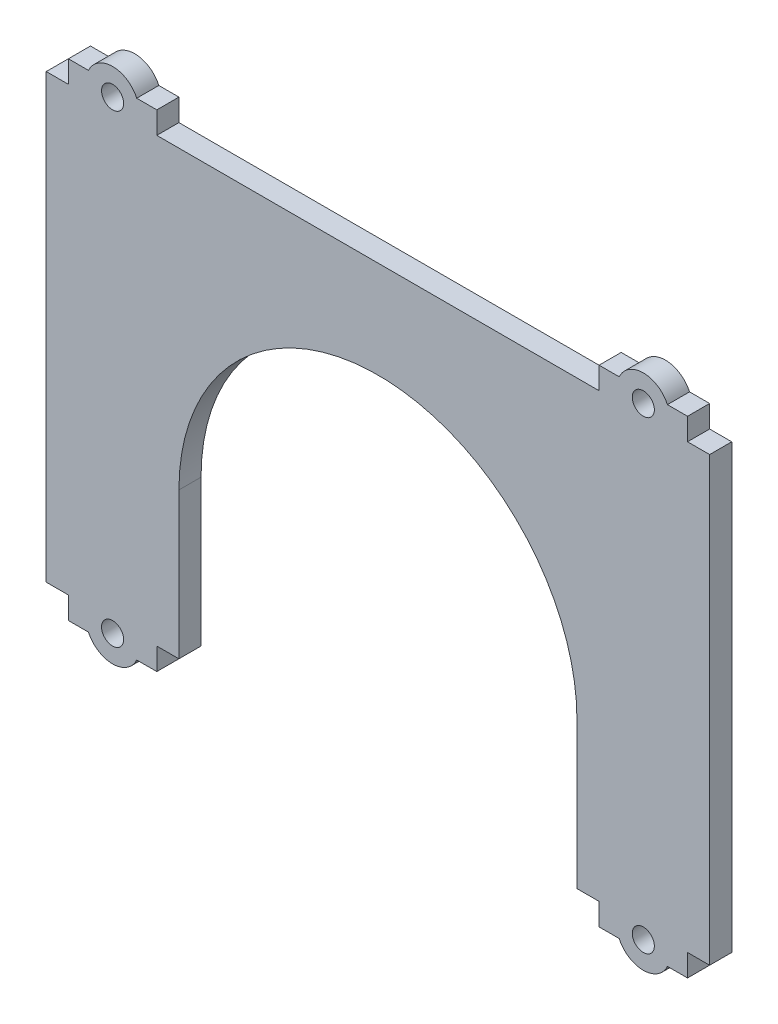
ISO-10303-21;
HEADER;
FILE_DESCRIPTION(('STEP AP214'),'2;1');
FILE_NAME('part.step','',(''),(''),'','','');
FILE_SCHEMA(('AUTOMOTIVE_DESIGN { 1 0 10303 214 1 1 1 1 }'));
ENDSEC;
DATA;
#1=APPLICATION_CONTEXT('core data for automotive mechanical design processes');
#2=APPLICATION_PROTOCOL_DEFINITION('international standard','automotive_design',2000,#1);
#3=PRODUCT_CONTEXT('',#1,'mechanical');
#4=PRODUCT('Part','Part','',(#3));
#5=PRODUCT_RELATED_PRODUCT_CATEGORY('part','',(#4));
#6=PRODUCT_DEFINITION_FORMATION('','',#4);
#7=PRODUCT_DEFINITION_CONTEXT('part definition',#1,'design');
#8=PRODUCT_DEFINITION('design','',#6,#7);
#9=PRODUCT_DEFINITION_SHAPE('','',#8);
#10=(LENGTH_UNIT() NAMED_UNIT(*) SI_UNIT(.MILLI.,.METRE.));
#11=(NAMED_UNIT(*) PLANE_ANGLE_UNIT() SI_UNIT($,.RADIAN.));
#12=(NAMED_UNIT(*) SI_UNIT($,.STERADIAN.) SOLID_ANGLE_UNIT());
#13=UNCERTAINTY_MEASURE_WITH_UNIT(LENGTH_MEASURE(1.E-05),#10,'distance_accuracy_value','');
#14=(GEOMETRIC_REPRESENTATION_CONTEXT(3) GLOBAL_UNCERTAINTY_ASSIGNED_CONTEXT((#13)) GLOBAL_UNIT_ASSIGNED_CONTEXT((#10,
#11,#12)) REPRESENTATION_CONTEXT('',''));
#15=CARTESIAN_POINT('',(0.,0.,0.));
#16=DIRECTION('',(0.,0.,1.));
#17=DIRECTION('',(1.,0.,0.));
#18=AXIS2_PLACEMENT_3D('',#15,#16,#17);
#19=CARTESIAN_POINT('',(75.,-50.,5.));
#20=DIRECTION('',(0.,1.,0.));
#21=DIRECTION('',(-1.,0.,0.));
#22=AXIS2_PLACEMENT_3D('',#19,#20,#21);
#23=PLANE('',#22);
#24=DIRECTION('',(0.,0.,-1.));
#25=VECTOR('',#24,1.);
#26=CARTESIAN_POINT('',(-45.,-50.,249.124704413899));
#27=LINE('',#26,#25);
#28=CARTESIAN_POINT('',(-45.,-50.,5.));
#29=VERTEX_POINT('',#28);
#30=CARTESIAN_POINT('',(-45.,-50.,0.));
#31=VERTEX_POINT('',#30);
#32=EDGE_CURVE('E254',#29,#31,#27,.T.);
#33=ORIENTED_EDGE('',*,*,#32,.F.);
#34=DIRECTION('',(1.,0.,0.));
#35=VECTOR('',#34,1.);
#36=CARTESIAN_POINT('',(75.,-50.,5.));
#37=LINE('',#36,#35);
#38=CARTESIAN_POINT('',(-50.,-50.,5.00000000000001));
#39=VERTEX_POINT('',#38);
#40=EDGE_CURVE('E446',#39,#29,#37,.T.);
#41=ORIENTED_EDGE('',*,*,#40,.F.);
#42=DIRECTION('',(0.,0.,1.));
#43=VECTOR('',#42,1.);
#44=CARTESIAN_POINT('',(-50.,-50.,0.));
#45=LINE('',#44,#43);
#46=CARTESIAN_POINT('',(-50.,-50.,0.));
#47=VERTEX_POINT('',#46);
#48=EDGE_CURVE('E412',#47,#39,#45,.T.);
#49=ORIENTED_EDGE('',*,*,#48,.F.);
#50=DIRECTION('',(1.,0.,0.));
#51=VECTOR('',#50,1.);
#52=CARTESIAN_POINT('',(75.,-50.,0.));
#53=LINE('',#52,#51);
#54=EDGE_CURVE('E461',#47,#31,#53,.T.);
#55=ORIENTED_EDGE('',*,*,#54,.T.);
#56=EDGE_LOOP('',(#33,#41,#49,#55));
#57=FACE_BOUND('',#56,.T.);
#58=ADVANCED_FACE('F35',(#57),#23,.F.);
#59=CARTESIAN_POINT('',(0.,0.,5.));
#60=DIRECTION('',(0.,0.,-1.));
#61=DIRECTION('',(-1.,0.,0.));
#62=AXIS2_PLACEMENT_3D('',#59,#60,#61);
#63=PLANE('',#62);
#64=CARTESIAN_POINT('',(60.,52.5,5.));
#65=DIRECTION('',(0.,0.,1.));
#66=DIRECTION('',(1.,0.,0.));
#67=AXIS2_PLACEMENT_3D('',#64,#65,#66);
#68=CIRCLE('',#67,2.5);
#69=CARTESIAN_POINT('',(62.5,52.5,5.));
#70=VERTEX_POINT('',#69);
#71=EDGE_CURVE('E304',#70,#70,#68,.T.);
#72=ORIENTED_EDGE('',*,*,#71,.F.);
#73=EDGE_LOOP('',(#72));
#74=FACE_BOUND('',#73,.T.);
#75=CARTESIAN_POINT('',(60.,-52.5,5.));
#76=DIRECTION('',(0.,0.,-1.));
#77=DIRECTION('',(1.,0.,0.));
#78=AXIS2_PLACEMENT_3D('',#75,#76,#77);
#79=CIRCLE('',#78,2.5);
#80=CARTESIAN_POINT('',(62.5,-52.5,5.));
#81=VERTEX_POINT('',#80);
#82=EDGE_CURVE('E281',#81,#81,#79,.T.);
#83=ORIENTED_EDGE('',*,*,#82,.T.);
#84=EDGE_LOOP('',(#83));
#85=FACE_BOUND('',#84,.T.);
#86=CARTESIAN_POINT('',(-60.,52.5,5.));
#87=DIRECTION('',(0.,0.,-1.));
#88=DIRECTION('',(-1.,0.,0.));
#89=AXIS2_PLACEMENT_3D('',#86,#87,#88);
#90=CIRCLE('',#89,2.5);
#91=CARTESIAN_POINT('',(-62.5,52.5,5.));
#92=VERTEX_POINT('',#91);
#93=EDGE_CURVE('E276',#92,#92,#90,.T.);
#94=ORIENTED_EDGE('',*,*,#93,.T.);
#95=EDGE_LOOP('',(#94));
#96=FACE_BOUND('',#95,.T.);
#97=CARTESIAN_POINT('',(-60.,-52.5,5.));
#98=DIRECTION('',(0.,0.,1.));
#99=DIRECTION('',(-1.,0.,0.));
#100=AXIS2_PLACEMENT_3D('',#97,#98,#99);
#101=CIRCLE('',#100,2.5);
#102=CARTESIAN_POINT('',(-62.5,-52.5,5.));
#103=VERTEX_POINT('',#102);
#104=EDGE_CURVE('E266',#103,#103,#101,.T.);
#105=ORIENTED_EDGE('',*,*,#104,.F.);
#106=EDGE_LOOP('',(#105));
#107=FACE_BOUND('',#106,.T.);
#108=DIRECTION('',(0.,1.,0.));
#109=VECTOR('',#108,1.);
#110=CARTESIAN_POINT('',(45.,-16.9280233832663,5.));
#111=LINE('',#110,#109);
#112=CARTESIAN_POINT('',(45.,-50.,5.));
#113=VERTEX_POINT('',#112);
#114=CARTESIAN_POINT('',(45.,-16.9280233832663,5.));
#115=VERTEX_POINT('',#114);
#116=EDGE_CURVE('E265',#113,#115,#111,.T.);
#117=ORIENTED_EDGE('',*,*,#116,.F.);
#118=CARTESIAN_POINT('',(50.,-50.,5.));
#119=VERTEX_POINT('',#118);
#120=EDGE_CURVE('E447',#113,#119,#37,.T.);
#121=ORIENTED_EDGE('',*,*,#120,.T.);
#122=DIRECTION('',(0.,1.,0.));
#123=VECTOR('',#122,1.);
#124=CARTESIAN_POINT('',(50.,-55.,5.00000000000001));
#125=LINE('',#124,#123);
#126=CARTESIAN_POINT('',(50.,-55.,5.00000000000001));
#127=VERTEX_POINT('',#126);
#128=EDGE_CURVE('E371',#127,#119,#125,.T.);
#129=ORIENTED_EDGE('',*,*,#128,.F.);
#130=DIRECTION('',(1.,0.,0.));
#131=VECTOR('',#130,1.);
#132=CARTESIAN_POINT('',(70.,-55.,5.));
#133=LINE('',#132,#131);
#134=CARTESIAN_POINT('',(54.5456439426821,-55.,5.));
#135=VERTEX_POINT('',#134);
#136=EDGE_CURVE('E352',#127,#135,#133,.T.);
#137=ORIENTED_EDGE('',*,*,#136,.T.);
#138=CARTESIAN_POINT('',(60.,-52.5,5.));
#139=DIRECTION('',(0.,0.,-1.));
#140=DIRECTION('',(1.,0.,0.));
#141=AXIS2_PLACEMENT_3D('',#138,#139,#140);
#142=CIRCLE('',#141,5.99999999999999);
#143=CARTESIAN_POINT('',(65.4543560573178,-55.,5.));
#144=VERTEX_POINT('',#143);
#145=EDGE_CURVE('E299',#144,#135,#142,.T.);
#146=ORIENTED_EDGE('',*,*,#145,.F.);
#147=CARTESIAN_POINT('',(70.,-55.,5.));
#148=VERTEX_POINT('',#147);
#149=EDGE_CURVE('E350',#144,#148,#133,.T.);
#150=ORIENTED_EDGE('',*,*,#149,.T.);
#151=DIRECTION('',(0.,1.,0.));
#152=VECTOR('',#151,1.);
#153=CARTESIAN_POINT('',(70.,-55.,5.));
#154=LINE('',#153,#152);
#155=CARTESIAN_POINT('',(70.,-50.,5.));
#156=VERTEX_POINT('',#155);
#157=EDGE_CURVE('E374',#148,#156,#154,.T.);
#158=ORIENTED_EDGE('',*,*,#157,.T.);
#159=CARTESIAN_POINT('',(75.,-50.,5.));
#160=VERTEX_POINT('',#159);
#161=EDGE_CURVE('E440',#156,#160,#37,.T.);
#162=ORIENTED_EDGE('',*,*,#161,.T.);
#163=DIRECTION('',(0.,1.,0.));
#164=VECTOR('',#163,1.);
#165=CARTESIAN_POINT('',(75.,50.,5.));
#166=LINE('',#165,#164);
#167=CARTESIAN_POINT('',(75.,50.,5.));
#168=VERTEX_POINT('',#167);
#169=EDGE_CURVE('E445',#160,#168,#166,.T.);
#170=ORIENTED_EDGE('',*,*,#169,.T.);
#171=DIRECTION('',(-1.,0.,0.));
#172=VECTOR('',#171,1.);
#173=CARTESIAN_POINT('',(75.,50.,5.));
#174=LINE('',#173,#172);
#175=CARTESIAN_POINT('',(70.,50.,5.));
#176=VERTEX_POINT('',#175);
#177=EDGE_CURVE('E450',#168,#176,#174,.T.);
#178=ORIENTED_EDGE('',*,*,#177,.T.);
#179=DIRECTION('',(0.,-1.,0.));
#180=VECTOR('',#179,1.);
#181=CARTESIAN_POINT('',(70.,55.,5.));
#182=LINE('',#181,#180);
#183=CARTESIAN_POINT('',(70.,55.,5.));
#184=VERTEX_POINT('',#183);
#185=EDGE_CURVE('E330',#184,#176,#182,.T.);
#186=ORIENTED_EDGE('',*,*,#185,.F.);
#187=DIRECTION('',(1.,0.,0.));
#188=VECTOR('',#187,1.);
#189=CARTESIAN_POINT('',(70.,55.,5.));
#190=LINE('',#189,#188);
#191=CARTESIAN_POINT('',(65.4543560573178,55.,5.));
#192=VERTEX_POINT('',#191);
#193=EDGE_CURVE('E327',#192,#184,#190,.T.);
#194=ORIENTED_EDGE('',*,*,#193,.F.);
#195=CARTESIAN_POINT('',(60.,52.5,5.));
#196=DIRECTION('',(0.,0.,1.));
#197=DIRECTION('',(1.,0.,0.));
#198=AXIS2_PLACEMENT_3D('',#195,#196,#197);
#199=CIRCLE('',#198,5.99999999999999);
#200=CARTESIAN_POINT('',(54.5456439426821,55.,5.00000000000001));
#201=VERTEX_POINT('',#200);
#202=EDGE_CURVE('E309',#192,#201,#199,.T.);
#203=ORIENTED_EDGE('',*,*,#202,.T.);
#204=CARTESIAN_POINT('',(50.,55.,5.00000000000001));
#205=VERTEX_POINT('',#204);
#206=EDGE_CURVE('E328',#205,#201,#190,.T.);
#207=ORIENTED_EDGE('',*,*,#206,.F.);
#208=DIRECTION('',(0.,-1.,0.));
#209=VECTOR('',#208,1.);
#210=CARTESIAN_POINT('',(50.,55.,5.00000000000001));
#211=LINE('',#210,#209);
#212=CARTESIAN_POINT('',(50.,50.,5.));
#213=VERTEX_POINT('',#212);
#214=EDGE_CURVE('E337',#205,#213,#211,.T.);
#215=ORIENTED_EDGE('',*,*,#214,.T.);
#216=CARTESIAN_POINT('',(-50.,50.,5.));
#217=VERTEX_POINT('',#216);
#218=EDGE_CURVE('E454',#213,#217,#174,.T.);
#219=ORIENTED_EDGE('',*,*,#218,.T.);
#220=DIRECTION('',(0.,-1.,0.));
#221=VECTOR('',#220,1.);
#222=CARTESIAN_POINT('',(-50.,55.,5.00000000000001));
#223=LINE('',#222,#221);
#224=CARTESIAN_POINT('',(-50.,55.,5.00000000000001));
#225=VERTEX_POINT('',#224);
#226=EDGE_CURVE('E402',#225,#217,#223,.T.);
#227=ORIENTED_EDGE('',*,*,#226,.F.);
#228=DIRECTION('',(-1.,0.,0.));
#229=VECTOR('',#228,1.);
#230=CARTESIAN_POINT('',(-70.,55.,5.));
#231=LINE('',#230,#229);
#232=CARTESIAN_POINT('',(-54.5456439426821,55.,5.));
#233=VERTEX_POINT('',#232);
#234=EDGE_CURVE('E383',#225,#233,#231,.T.);
#235=ORIENTED_EDGE('',*,*,#234,.T.);
#236=CARTESIAN_POINT('',(-60.,52.5,5.));
#237=DIRECTION('',(0.,0.,-1.));
#238=DIRECTION('',(-1.,0.,0.));
#239=AXIS2_PLACEMENT_3D('',#236,#237,#238);
#240=CIRCLE('',#239,5.99999999999999);
#241=CARTESIAN_POINT('',(-65.4543560573178,55.,5.));
#242=VERTEX_POINT('',#241);
#243=EDGE_CURVE('E293',#242,#233,#240,.T.);
#244=ORIENTED_EDGE('',*,*,#243,.F.);
#245=CARTESIAN_POINT('',(-70.,55.,5.));
#246=VERTEX_POINT('',#245);
#247=EDGE_CURVE('E381',#242,#246,#231,.T.);
#248=ORIENTED_EDGE('',*,*,#247,.T.);
#249=DIRECTION('',(0.,-1.,0.));
#250=VECTOR('',#249,1.);
#251=CARTESIAN_POINT('',(-70.,55.,5.));
#252=LINE('',#251,#250);
#253=CARTESIAN_POINT('',(-70.,50.,5.));
#254=VERTEX_POINT('',#253);
#255=EDGE_CURVE('E405',#246,#254,#252,.T.);
#256=ORIENTED_EDGE('',*,*,#255,.T.);
#257=CARTESIAN_POINT('',(-75.,50.,5.));
#258=VERTEX_POINT('',#257);
#259=EDGE_CURVE('E449',#254,#258,#174,.T.);
#260=ORIENTED_EDGE('',*,*,#259,.T.);
#261=DIRECTION('',(0.,-1.,0.));
#262=VECTOR('',#261,1.);
#263=CARTESIAN_POINT('',(-75.,50.,5.));
#264=LINE('',#263,#262);
#265=CARTESIAN_POINT('',(-75.,-50.,5.));
#266=VERTEX_POINT('',#265);
#267=EDGE_CURVE('E437',#258,#266,#264,.T.);
#268=ORIENTED_EDGE('',*,*,#267,.T.);
#269=CARTESIAN_POINT('',(-70.,-50.,5.));
#270=VERTEX_POINT('',#269);
#271=EDGE_CURVE('E442',#266,#270,#37,.T.);
#272=ORIENTED_EDGE('',*,*,#271,.T.);
#273=DIRECTION('',(0.,1.,0.));
#274=VECTOR('',#273,1.);
#275=CARTESIAN_POINT('',(-70.,-55.,5.));
#276=LINE('',#275,#274);
#277=CARTESIAN_POINT('',(-70.,-55.,5.));
#278=VERTEX_POINT('',#277);
#279=EDGE_CURVE('E420',#278,#270,#276,.T.);
#280=ORIENTED_EDGE('',*,*,#279,.F.);
#281=DIRECTION('',(-1.,0.,0.));
#282=VECTOR('',#281,1.);
#283=CARTESIAN_POINT('',(-70.,-55.,5.));
#284=LINE('',#283,#282);
#285=CARTESIAN_POINT('',(-65.4543560573178,-55.,5.));
#286=VERTEX_POINT('',#285);
#287=EDGE_CURVE('E417',#286,#278,#284,.T.);
#288=ORIENTED_EDGE('',*,*,#287,.F.);
#289=CARTESIAN_POINT('',(-60.,-52.5,5.));
#290=DIRECTION('',(0.,0.,1.));
#291=DIRECTION('',(-1.,0.,0.));
#292=AXIS2_PLACEMENT_3D('',#289,#290,#291);
#293=CIRCLE('',#292,5.99999999999999);
#294=CARTESIAN_POINT('',(-54.5456439426821,-55.,5.00000000000001));
#295=VERTEX_POINT('',#294);
#296=EDGE_CURVE('E287',#286,#295,#293,.T.);
#297=ORIENTED_EDGE('',*,*,#296,.T.);
#298=CARTESIAN_POINT('',(-50.,-55.,5.00000000000001));
#299=VERTEX_POINT('',#298);
#300=EDGE_CURVE('E418',#299,#295,#284,.T.);
#301=ORIENTED_EDGE('',*,*,#300,.F.);
#302=DIRECTION('',(0.,1.,0.));
#303=VECTOR('',#302,1.);
#304=CARTESIAN_POINT('',(-50.,-55.,5.00000000000001));
#305=LINE('',#304,#303);
#306=EDGE_CURVE('E427',#299,#39,#305,.T.);
#307=ORIENTED_EDGE('',*,*,#306,.T.);
#308=ORIENTED_EDGE('',*,*,#40,.T.);
#309=DIRECTION('',(0.,-1.,0.));
#310=VECTOR('',#309,1.);
#311=CARTESIAN_POINT('',(-45.,-16.9280233832663,5.));
#312=LINE('',#311,#310);
#313=CARTESIAN_POINT('',(-45.,-16.9280233832663,5.));
#314=VERTEX_POINT('',#313);
#315=EDGE_CURVE('E55',#314,#29,#312,.T.);
#316=ORIENTED_EDGE('',*,*,#315,.F.);
#317=CARTESIAN_POINT('',(0.,-16.9280233832663,5.));
#318=DIRECTION('',(0.,0.,-1.));
#319=DIRECTION('',(-1.,0.,0.));
#320=AXIS2_PLACEMENT_3D('',#317,#318,#319);
#321=CIRCLE('',#320,45.);
#322=EDGE_CURVE('E50',#115,#314,#321,.F.);
#323=ORIENTED_EDGE('',*,*,#322,.F.);
#324=EDGE_LOOP('',(#117,#121,#129,#137,#146,#150,#158,#162,#170,#178,#186,#194,#203,#207,#215,
#219,#227,#235,#244,#248,#256,#260,#268,#272,#280,#288,#297,#301,#307,#308,#316,#323));
#325=FACE_BOUND('',#324,.T.);
#326=ADVANCED_FACE('F514',(#74,#85,#96,#107,#325),#63,.F.);
#327=CARTESIAN_POINT('',(0.,0.,0.));
#328=DIRECTION('',(0.,0.,-1.));
#329=DIRECTION('',(-1.,0.,0.));
#330=AXIS2_PLACEMENT_3D('',#327,#328,#329);
#331=PLANE('',#330);
#332=CARTESIAN_POINT('',(-60.,-52.5,0.));
#333=DIRECTION('',(0.,0.,1.));
#334=DIRECTION('',(-1.,0.,0.));
#335=AXIS2_PLACEMENT_3D('',#332,#333,#334);
#336=CIRCLE('',#335,2.5);
#337=CARTESIAN_POINT('',(-62.5,-52.5,0.));
#338=VERTEX_POINT('',#337);
#339=EDGE_CURVE('E270',#338,#338,#336,.T.);
#340=ORIENTED_EDGE('',*,*,#339,.T.);
#341=EDGE_LOOP('',(#340));
#342=FACE_BOUND('',#341,.T.);
#343=CARTESIAN_POINT('',(-60.,52.5,0.));
#344=DIRECTION('',(0.,0.,-1.));
#345=DIRECTION('',(-1.,0.,0.));
#346=AXIS2_PLACEMENT_3D('',#343,#344,#345);
#347=CIRCLE('',#346,2.5);
#348=CARTESIAN_POINT('',(-62.5,52.5,0.));
#349=VERTEX_POINT('',#348);
#350=EDGE_CURVE('E278',#349,#349,#347,.T.);
#351=ORIENTED_EDGE('',*,*,#350,.F.);
#352=EDGE_LOOP('',(#351));
#353=FACE_BOUND('',#352,.T.);
#354=CARTESIAN_POINT('',(60.,-52.5,0.));
#355=DIRECTION('',(0.,0.,-1.));
#356=DIRECTION('',(1.,0.,0.));
#357=AXIS2_PLACEMENT_3D('',#354,#355,#356);
#358=CIRCLE('',#357,2.5);
#359=CARTESIAN_POINT('',(62.5,-52.5,0.));
#360=VERTEX_POINT('',#359);
#361=EDGE_CURVE('E284',#360,#360,#358,.T.);
#362=ORIENTED_EDGE('',*,*,#361,.F.);
#363=EDGE_LOOP('',(#362));
#364=FACE_BOUND('',#363,.T.);
#365=CARTESIAN_POINT('',(60.,52.5,0.));
#366=DIRECTION('',(0.,0.,1.));
#367=DIRECTION('',(1.,0.,0.));
#368=AXIS2_PLACEMENT_3D('',#365,#366,#367);
#369=CIRCLE('',#368,2.5);
#370=CARTESIAN_POINT('',(62.5,52.5,0.));
#371=VERTEX_POINT('',#370);
#372=EDGE_CURVE('E306',#371,#371,#369,.T.);
#373=ORIENTED_EDGE('',*,*,#372,.T.);
#374=EDGE_LOOP('',(#373));
#375=FACE_BOUND('',#374,.T.);
#376=CARTESIAN_POINT('',(0.,-16.9280233832663,0.));
#377=DIRECTION('',(0.,0.,-1.));
#378=DIRECTION('',(-1.,0.,0.));
#379=AXIS2_PLACEMENT_3D('',#376,#377,#378);
#380=CIRCLE('',#379,45.);
#381=CARTESIAN_POINT('',(45.,-16.9280233832663,0.));
#382=VERTEX_POINT('',#381);
#383=CARTESIAN_POINT('',(-45.,-16.9280233832663,0.));
#384=VERTEX_POINT('',#383);
#385=EDGE_CURVE('E247',#382,#384,#380,.F.);
#386=ORIENTED_EDGE('',*,*,#385,.T.);
#387=DIRECTION('',(0.,-1.,0.));
#388=VECTOR('',#387,1.);
#389=CARTESIAN_POINT('',(-45.,-16.9280233832663,0.));
#390=LINE('',#389,#388);
#391=EDGE_CURVE('E262',#384,#31,#390,.T.);
#392=ORIENTED_EDGE('',*,*,#391,.T.);
#393=ORIENTED_EDGE('',*,*,#54,.F.);
#394=DIRECTION('',(0.,1.,0.));
#395=VECTOR('',#394,1.);
#396=CARTESIAN_POINT('',(-50.,-55.,0.));
#397=LINE('',#396,#395);
#398=CARTESIAN_POINT('',(-50.,-55.,0.));
#399=VERTEX_POINT('',#398);
#400=EDGE_CURVE('E430',#399,#47,#397,.T.);
#401=ORIENTED_EDGE('',*,*,#400,.F.);
#402=DIRECTION('',(1.,0.,0.));
#403=VECTOR('',#402,1.);
#404=CARTESIAN_POINT('',(-70.,-55.,0.));
#405=LINE('',#404,#403);
#406=CARTESIAN_POINT('',(-54.5456439426821,-55.,0.));
#407=VERTEX_POINT('',#406);
#408=EDGE_CURVE('E411',#407,#399,#405,.T.);
#409=ORIENTED_EDGE('',*,*,#408,.F.);
#410=CARTESIAN_POINT('',(-60.,-52.5,0.));
#411=DIRECTION('',(0.,0.,1.));
#412=DIRECTION('',(-1.,0.,0.));
#413=AXIS2_PLACEMENT_3D('',#410,#411,#412);
#414=CIRCLE('',#413,5.99999999999999);
#415=CARTESIAN_POINT('',(-65.4543560573178,-55.,0.));
#416=VERTEX_POINT('',#415);
#417=EDGE_CURVE('E290',#416,#407,#414,.T.);
#418=ORIENTED_EDGE('',*,*,#417,.F.);
#419=CARTESIAN_POINT('',(-70.,-55.,0.));
#420=VERTEX_POINT('',#419);
#421=EDGE_CURVE('E413',#420,#416,#405,.T.);
#422=ORIENTED_EDGE('',*,*,#421,.F.);
#423=DIRECTION('',(0.,1.,0.));
#424=VECTOR('',#423,1.);
#425=CARTESIAN_POINT('',(-70.,-55.,0.));
#426=LINE('',#425,#424);
#427=CARTESIAN_POINT('',(-70.,-50.,0.));
#428=VERTEX_POINT('',#427);
#429=EDGE_CURVE('E433',#420,#428,#426,.T.);
#430=ORIENTED_EDGE('',*,*,#429,.T.);
#431=CARTESIAN_POINT('',(-75.,-50.,0.));
#432=VERTEX_POINT('',#431);
#433=EDGE_CURVE('E458',#432,#428,#53,.T.);
#434=ORIENTED_EDGE('',*,*,#433,.F.);
#435=DIRECTION('',(0.,-1.,0.));
#436=VECTOR('',#435,1.);
#437=CARTESIAN_POINT('',(-75.,50.,0.));
#438=LINE('',#437,#436);
#439=CARTESIAN_POINT('',(-75.,50.,0.));
#440=VERTEX_POINT('',#439);
#441=EDGE_CURVE('E436',#440,#432,#438,.T.);
#442=ORIENTED_EDGE('',*,*,#441,.F.);
#443=DIRECTION('',(-1.,0.,0.));
#444=VECTOR('',#443,1.);
#445=CARTESIAN_POINT('',(75.,50.,0.));
#446=LINE('',#445,#444);
#447=CARTESIAN_POINT('',(-70.,50.,0.));
#448=VERTEX_POINT('',#447);
#449=EDGE_CURVE('E463',#448,#440,#446,.T.);
#450=ORIENTED_EDGE('',*,*,#449,.F.);
#451=DIRECTION('',(0.,-1.,0.));
#452=VECTOR('',#451,1.);
#453=CARTESIAN_POINT('',(-70.,55.,0.));
#454=LINE('',#453,#452);
#455=CARTESIAN_POINT('',(-70.,55.,0.));
#456=VERTEX_POINT('',#455);
#457=EDGE_CURVE('E393',#456,#448,#454,.T.);
#458=ORIENTED_EDGE('',*,*,#457,.F.);
#459=DIRECTION('',(1.,0.,0.));
#460=VECTOR('',#459,1.);
#461=CARTESIAN_POINT('',(-70.,55.,0.));
#462=LINE('',#461,#460);
#463=CARTESIAN_POINT('',(-65.4543560573178,55.,0.));
#464=VERTEX_POINT('',#463);
#465=EDGE_CURVE('E390',#456,#464,#462,.T.);
#466=ORIENTED_EDGE('',*,*,#465,.T.);
#467=CARTESIAN_POINT('',(-60.,52.5,0.));
#468=DIRECTION('',(0.,0.,-1.));
#469=DIRECTION('',(-1.,0.,0.));
#470=AXIS2_PLACEMENT_3D('',#467,#468,#469);
#471=CIRCLE('',#470,5.99999999999999);
#472=CARTESIAN_POINT('',(-54.5456439426821,55.,0.));
#473=VERTEX_POINT('',#472);
#474=EDGE_CURVE('E296',#464,#473,#471,.T.);
#475=ORIENTED_EDGE('',*,*,#474,.T.);
#476=CARTESIAN_POINT('',(-50.,55.,0.));
#477=VERTEX_POINT('',#476);
#478=EDGE_CURVE('E389',#473,#477,#462,.T.);
#479=ORIENTED_EDGE('',*,*,#478,.T.);
#480=DIRECTION('',(0.,-1.,0.));
#481=VECTOR('',#480,1.);
#482=CARTESIAN_POINT('',(-50.,55.,0.));
#483=LINE('',#482,#481);
#484=CARTESIAN_POINT('',(-50.,50.,0.));
#485=VERTEX_POINT('',#484);
#486=EDGE_CURVE('E399',#477,#485,#483,.T.);
#487=ORIENTED_EDGE('',*,*,#486,.T.);
#488=CARTESIAN_POINT('',(50.,50.,0.));
#489=VERTEX_POINT('',#488);
#490=EDGE_CURVE('E465',#489,#485,#446,.T.);
#491=ORIENTED_EDGE('',*,*,#490,.F.);
#492=DIRECTION('',(0.,-1.,0.));
#493=VECTOR('',#492,1.);
#494=CARTESIAN_POINT('',(50.,55.,0.));
#495=LINE('',#494,#493);
#496=CARTESIAN_POINT('',(50.,55.,0.));
#497=VERTEX_POINT('',#496);
#498=EDGE_CURVE('E340',#497,#489,#495,.T.);
#499=ORIENTED_EDGE('',*,*,#498,.F.);
#500=DIRECTION('',(-1.,0.,0.));
#501=VECTOR('',#500,1.);
#502=CARTESIAN_POINT('',(70.,55.,0.));
#503=LINE('',#502,#501);
#504=CARTESIAN_POINT('',(54.5456439426821,55.,0.));
#505=VERTEX_POINT('',#504);
#506=EDGE_CURVE('E321',#505,#497,#503,.T.);
#507=ORIENTED_EDGE('',*,*,#506,.F.);
#508=CARTESIAN_POINT('',(60.,52.5,0.));
#509=DIRECTION('',(0.,0.,1.));
#510=DIRECTION('',(1.,0.,0.));
#511=AXIS2_PLACEMENT_3D('',#508,#509,#510);
#512=CIRCLE('',#511,5.99999999999999);
#513=CARTESIAN_POINT('',(65.4543560573178,55.,0.));
#514=VERTEX_POINT('',#513);
#515=EDGE_CURVE('E312',#514,#505,#512,.T.);
#516=ORIENTED_EDGE('',*,*,#515,.F.);
#517=CARTESIAN_POINT('',(70.,55.,0.));
#518=VERTEX_POINT('',#517);
#519=EDGE_CURVE('E323',#518,#514,#503,.T.);
#520=ORIENTED_EDGE('',*,*,#519,.F.);
#521=DIRECTION('',(0.,-1.,0.));
#522=VECTOR('',#521,1.);
#523=CARTESIAN_POINT('',(70.,55.,0.));
#524=LINE('',#523,#522);
#525=CARTESIAN_POINT('',(70.,50.,0.));
#526=VERTEX_POINT('',#525);
#527=EDGE_CURVE('E343',#518,#526,#524,.T.);
#528=ORIENTED_EDGE('',*,*,#527,.T.);
#529=CARTESIAN_POINT('',(75.,50.,0.));
#530=VERTEX_POINT('',#529);
#531=EDGE_CURVE('E441',#530,#526,#446,.T.);
#532=ORIENTED_EDGE('',*,*,#531,.F.);
#533=DIRECTION('',(0.,1.,0.));
#534=VECTOR('',#533,1.);
#535=CARTESIAN_POINT('',(75.,50.,0.));
#536=LINE('',#535,#534);
#537=CARTESIAN_POINT('',(75.,-50.,0.));
#538=VERTEX_POINT('',#537);
#539=EDGE_CURVE('E460',#538,#530,#536,.T.);
#540=ORIENTED_EDGE('',*,*,#539,.F.);
#541=CARTESIAN_POINT('',(70.,-50.,0.));
#542=VERTEX_POINT('',#541);
#543=EDGE_CURVE('E457',#542,#538,#53,.T.);
#544=ORIENTED_EDGE('',*,*,#543,.F.);
#545=DIRECTION('',(0.,1.,0.));
#546=VECTOR('',#545,1.);
#547=CARTESIAN_POINT('',(70.,-55.,0.));
#548=LINE('',#547,#546);
#549=CARTESIAN_POINT('',(70.,-55.,0.));
#550=VERTEX_POINT('',#549);
#551=EDGE_CURVE('E362',#550,#542,#548,.T.);
#552=ORIENTED_EDGE('',*,*,#551,.F.);
#553=DIRECTION('',(-1.,0.,0.));
#554=VECTOR('',#553,1.);
#555=CARTESIAN_POINT('',(70.,-55.,0.));
#556=LINE('',#555,#554);
#557=CARTESIAN_POINT('',(65.4543560573178,-55.,0.));
#558=VERTEX_POINT('',#557);
#559=EDGE_CURVE('E359',#550,#558,#556,.T.);
#560=ORIENTED_EDGE('',*,*,#559,.T.);
#561=CARTESIAN_POINT('',(60.,-52.5,0.));
#562=DIRECTION('',(0.,0.,-1.));
#563=DIRECTION('',(1.,0.,0.));
#564=AXIS2_PLACEMENT_3D('',#561,#562,#563);
#565=CIRCLE('',#564,5.99999999999999);
#566=CARTESIAN_POINT('',(54.5456439426821,-55.,0.));
#567=VERTEX_POINT('',#566);
#568=EDGE_CURVE('E301',#558,#567,#565,.T.);
#569=ORIENTED_EDGE('',*,*,#568,.T.);
#570=CARTESIAN_POINT('',(50.,-55.,0.));
#571=VERTEX_POINT('',#570);
#572=EDGE_CURVE('E358',#567,#571,#556,.T.);
#573=ORIENTED_EDGE('',*,*,#572,.T.);
#574=DIRECTION('',(0.,1.,0.));
#575=VECTOR('',#574,1.);
#576=CARTESIAN_POINT('',(50.,-55.,0.));
#577=LINE('',#576,#575);
#578=CARTESIAN_POINT('',(50.,-50.,0.));
#579=VERTEX_POINT('',#578);
#580=EDGE_CURVE('E369',#571,#579,#577,.T.);
#581=ORIENTED_EDGE('',*,*,#580,.T.);
#582=CARTESIAN_POINT('',(45.,-50.,0.));
#583=VERTEX_POINT('',#582);
#584=EDGE_CURVE('E250',#583,#579,#53,.T.);
#585=ORIENTED_EDGE('',*,*,#584,.F.);
#586=DIRECTION('',(0.,1.,0.));
#587=VECTOR('',#586,1.);
#588=CARTESIAN_POINT('',(45.,-16.9280233832663,0.));
#589=LINE('',#588,#587);
#590=EDGE_CURVE('E244',#583,#382,#589,.T.);
#591=ORIENTED_EDGE('',*,*,#590,.T.);
#592=EDGE_LOOP('',(#386,#392,#393,#401,#409,#418,#422,#430,#434,#442,#450,#458,#466,#475,#479,
#487,#491,#499,#507,#516,#520,#528,#532,#540,#544,#552,#560,#569,#573,#581,#585,#591));
#593=FACE_BOUND('',#592,.T.);
#594=ADVANCED_FACE('F246',(#342,#353,#364,#375,#593),#331,.T.);
#595=CARTESIAN_POINT('',(0.,-55.,0.));
#596=DIRECTION('',(0.,1.,0.));
#597=DIRECTION('',(0.,0.,1.));
#598=AXIS2_PLACEMENT_3D('',#595,#596,#597);
#599=PLANE('',#598);
#600=ORIENTED_EDGE('',*,*,#421,.T.);
#601=DIRECTION('',(0.,0.,1.));
#602=VECTOR('',#601,1.);
#603=CARTESIAN_POINT('',(-65.4543560573178,-55.,0.));
#604=LINE('',#603,#602);
#605=EDGE_CURVE('E11',#416,#286,#604,.T.);
#606=ORIENTED_EDGE('',*,*,#605,.T.);
#607=ORIENTED_EDGE('',*,*,#287,.T.);
#608=DIRECTION('',(0.,0.,-1.));
#609=VECTOR('',#608,1.);
#610=CARTESIAN_POINT('',(-70.,-55.,0.));
#611=LINE('',#610,#609);
#612=EDGE_CURVE('E408',#278,#420,#611,.T.);
#613=ORIENTED_EDGE('',*,*,#612,.T.);
#614=EDGE_LOOP('',(#600,#606,#607,#613));
#615=FACE_BOUND('',#614,.T.);
#616=ADVANCED_FACE('F505',(#615),#599,.F.);
#617=CARTESIAN_POINT('',(0.,55.,0.));
#618=DIRECTION('',(0.,-1.,0.));
#619=DIRECTION('',(0.,0.,1.));
#620=AXIS2_PLACEMENT_3D('',#617,#618,#619);
#621=PLANE('',#620);
#622=DIRECTION('',(0.,0.,1.));
#623=VECTOR('',#622,1.);
#624=CARTESIAN_POINT('',(-54.5456439426821,55.,0.));
#625=LINE('',#624,#623);
#626=EDGE_CURVE('E490',#233,#473,#625,.F.);
#627=ORIENTED_EDGE('',*,*,#626,.F.);
#628=ORIENTED_EDGE('',*,*,#234,.F.);
#629=DIRECTION('',(0.,0.,1.));
#630=VECTOR('',#629,1.);
#631=CARTESIAN_POINT('',(-50.,55.,0.));
#632=LINE('',#631,#630);
#633=EDGE_CURVE('E386',#477,#225,#632,.T.);
#634=ORIENTED_EDGE('',*,*,#633,.F.);
#635=ORIENTED_EDGE('',*,*,#478,.F.);
#636=EDGE_LOOP('',(#627,#628,#634,#635));
#637=FACE_BOUND('',#636,.T.);
#638=ADVANCED_FACE('F535',(#637),#621,.F.);
#639=DIRECTION('',(0.,0.,1.));
#640=VECTOR('',#639,1.);
#641=CARTESIAN_POINT('',(-65.4543560573178,55.,0.));
#642=LINE('',#641,#640);
#643=EDGE_CURVE('E487',#464,#242,#642,.T.);
#644=ORIENTED_EDGE('',*,*,#643,.F.);
#645=ORIENTED_EDGE('',*,*,#465,.F.);
#646=DIRECTION('',(0.,0.,-1.));
#647=VECTOR('',#646,1.);
#648=CARTESIAN_POINT('',(-70.,55.,0.));
#649=LINE('',#648,#647);
#650=EDGE_CURVE('E378',#246,#456,#649,.T.);
#651=ORIENTED_EDGE('',*,*,#650,.F.);
#652=ORIENTED_EDGE('',*,*,#247,.F.);
#653=EDGE_LOOP('',(#644,#645,#651,#652));
#654=FACE_BOUND('',#653,.T.);
#655=ADVANCED_FACE('F542',(#654),#621,.F.);
#656=CARTESIAN_POINT('',(0.,-55.,0.));
#657=DIRECTION('',(0.,1.,0.));
#658=DIRECTION('',(0.,0.,1.));
#659=AXIS2_PLACEMENT_3D('',#656,#657,#658);
#660=PLANE('',#659);
#661=DIRECTION('',(0.,0.,1.));
#662=VECTOR('',#661,1.);
#663=CARTESIAN_POINT('',(54.5456439426821,-55.,0.));
#664=LINE('',#663,#662);
#665=EDGE_CURVE('E485',#135,#567,#664,.F.);
#666=ORIENTED_EDGE('',*,*,#665,.F.);
#667=ORIENTED_EDGE('',*,*,#136,.F.);
#668=DIRECTION('',(0.,0.,1.));
#669=VECTOR('',#668,1.);
#670=CARTESIAN_POINT('',(50.,-55.,0.));
#671=LINE('',#670,#669);
#672=EDGE_CURVE('E355',#571,#127,#671,.T.);
#673=ORIENTED_EDGE('',*,*,#672,.F.);
#674=ORIENTED_EDGE('',*,*,#572,.F.);
#675=EDGE_LOOP('',(#666,#667,#673,#674));
#676=FACE_BOUND('',#675,.T.);
#677=ADVANCED_FACE('F652',(#676),#660,.F.);
#678=DIRECTION('',(0.,0.,1.));
#679=VECTOR('',#678,1.);
#680=CARTESIAN_POINT('',(65.4543560573178,-55.,0.));
#681=LINE('',#680,#679);
#682=EDGE_CURVE('E482',#558,#144,#681,.T.);
#683=ORIENTED_EDGE('',*,*,#682,.F.);
#684=ORIENTED_EDGE('',*,*,#559,.F.);
#685=DIRECTION('',(0.,0.,-1.));
#686=VECTOR('',#685,1.);
#687=CARTESIAN_POINT('',(70.,-55.,0.));
#688=LINE('',#687,#686);
#689=EDGE_CURVE('E347',#148,#550,#688,.T.);
#690=ORIENTED_EDGE('',*,*,#689,.F.);
#691=ORIENTED_EDGE('',*,*,#149,.F.);
#692=EDGE_LOOP('',(#683,#684,#690,#691));
#693=FACE_BOUND('',#692,.T.);
#694=ADVANCED_FACE('F655',(#693),#660,.F.);
#695=CARTESIAN_POINT('',(0.,55.,0.));
#696=DIRECTION('',(0.,-1.,0.));
#697=DIRECTION('',(0.,0.,1.));
#698=AXIS2_PLACEMENT_3D('',#695,#696,#697);
#699=PLANE('',#698);
#700=ORIENTED_EDGE('',*,*,#519,.T.);
#701=DIRECTION('',(0.,0.,1.));
#702=VECTOR('',#701,1.);
#703=CARTESIAN_POINT('',(65.4543560573178,55.,0.));
#704=LINE('',#703,#702);
#705=EDGE_CURVE('E479',#514,#192,#704,.T.);
#706=ORIENTED_EDGE('',*,*,#705,.T.);
#707=ORIENTED_EDGE('',*,*,#193,.T.);
#708=DIRECTION('',(0.,0.,-1.));
#709=VECTOR('',#708,1.);
#710=CARTESIAN_POINT('',(70.,55.,0.));
#711=LINE('',#710,#709);
#712=EDGE_CURVE('E318',#184,#518,#711,.T.);
#713=ORIENTED_EDGE('',*,*,#712,.T.);
#714=EDGE_LOOP('',(#700,#706,#707,#713));
#715=FACE_BOUND('',#714,.T.);
#716=ADVANCED_FACE('F562',(#715),#699,.F.);
#717=CARTESIAN_POINT('',(75.,50.,5.));
#718=DIRECTION('',(0.,-1.,0.));
#719=DIRECTION('',(1.,0.,0.));
#720=AXIS2_PLACEMENT_3D('',#717,#718,#719);
#721=PLANE('',#720);
#722=DIRECTION('',(0.,0.,-1.));
#723=VECTOR('',#722,1.);
#724=CARTESIAN_POINT('',(70.,50.,0.));
#725=LINE('',#724,#723);
#726=EDGE_CURVE('E315',#176,#526,#725,.T.);
#727=ORIENTED_EDGE('',*,*,#726,.F.);
#728=ORIENTED_EDGE('',*,*,#177,.F.);
#729=DIRECTION('',(0.,0.,-1.));
#730=VECTOR('',#729,1.);
#731=CARTESIAN_POINT('',(75.,50.,5.));
#732=LINE('',#731,#730);
#733=EDGE_CURVE('E468',#168,#530,#732,.T.);
#734=ORIENTED_EDGE('',*,*,#733,.T.);
#735=ORIENTED_EDGE('',*,*,#531,.T.);
#736=EDGE_LOOP('',(#727,#728,#734,#735));
#737=FACE_BOUND('',#736,.T.);
#738=ADVANCED_FACE('F552',(#737),#721,.F.);
#739=DIRECTION('',(0.,0.,1.));
#740=VECTOR('',#739,1.);
#741=CARTESIAN_POINT('',(50.,50.,0.));
#742=LINE('',#741,#740);
#743=EDGE_CURVE('E322',#489,#213,#742,.T.);
#744=ORIENTED_EDGE('',*,*,#743,.F.);
#745=ORIENTED_EDGE('',*,*,#490,.T.);
#746=DIRECTION('',(0.,0.,1.));
#747=VECTOR('',#746,1.);
#748=CARTESIAN_POINT('',(-50.,50.,0.));
#749=LINE('',#748,#747);
#750=EDGE_CURVE('E382',#485,#217,#749,.T.);
#751=ORIENTED_EDGE('',*,*,#750,.T.);
#752=ORIENTED_EDGE('',*,*,#218,.F.);
#753=EDGE_LOOP('',(#744,#745,#751,#752));
#754=FACE_BOUND('',#753,.T.);
#755=ADVANCED_FACE('F524',(#754),#721,.F.);
#756=ORIENTED_EDGE('',*,*,#161,.F.);
#757=DIRECTION('',(0.,0.,-1.));
#758=VECTOR('',#757,1.);
#759=CARTESIAN_POINT('',(70.,-50.,0.));
#760=LINE('',#759,#758);
#761=EDGE_CURVE('E346',#156,#542,#760,.T.);
#762=ORIENTED_EDGE('',*,*,#761,.T.);
#763=ORIENTED_EDGE('',*,*,#543,.T.);
#764=DIRECTION('',(0.,0.,-1.));
#765=VECTOR('',#764,1.);
#766=CARTESIAN_POINT('',(75.,-50.,5.));
#767=LINE('',#766,#765);
#768=EDGE_CURVE('E471',#160,#538,#767,.T.);
#769=ORIENTED_EDGE('',*,*,#768,.F.);
#770=EDGE_LOOP('',(#756,#762,#763,#769));
#771=FACE_BOUND('',#770,.T.);
#772=ADVANCED_FACE('F550',(#771),#23,.F.);
#773=ORIENTED_EDGE('',*,*,#259,.F.);
#774=DIRECTION('',(0.,0.,-1.));
#775=VECTOR('',#774,1.);
#776=CARTESIAN_POINT('',(-70.,50.,0.));
#777=LINE('',#776,#775);
#778=EDGE_CURVE('E377',#254,#448,#777,.T.);
#779=ORIENTED_EDGE('',*,*,#778,.T.);
#780=ORIENTED_EDGE('',*,*,#449,.T.);
#781=DIRECTION('',(0.,0.,-1.));
#782=VECTOR('',#781,1.);
#783=CARTESIAN_POINT('',(-75.,50.,5.));
#784=LINE('',#783,#782);
#785=EDGE_CURVE('E453',#258,#440,#784,.T.);
#786=ORIENTED_EDGE('',*,*,#785,.F.);
#787=EDGE_LOOP('',(#773,#779,#780,#786));
#788=FACE_BOUND('',#787,.T.);
#789=ADVANCED_FACE('F548',(#788),#721,.F.);
#790=DIRECTION('',(0.,0.,-1.));
#791=VECTOR('',#790,1.);
#792=CARTESIAN_POINT('',(-70.,-50.,0.));
#793=LINE('',#792,#791);
#794=EDGE_CURVE('E407',#270,#428,#793,.T.);
#795=ORIENTED_EDGE('',*,*,#794,.F.);
#796=ORIENTED_EDGE('',*,*,#271,.F.);
#797=DIRECTION('',(0.,0.,-1.));
#798=VECTOR('',#797,1.);
#799=CARTESIAN_POINT('',(-75.,-50.,5.));
#800=LINE('',#799,#798);
#801=EDGE_CURVE('E474',#266,#432,#800,.T.);
#802=ORIENTED_EDGE('',*,*,#801,.T.);
#803=ORIENTED_EDGE('',*,*,#433,.T.);
#804=EDGE_LOOP('',(#795,#796,#802,#803));
#805=FACE_BOUND('',#804,.T.);
#806=ADVANCED_FACE('F513',(#805),#23,.F.);
#807=ORIENTED_EDGE('',*,*,#120,.F.);
#808=DIRECTION('',(0.,0.,-1.));
#809=VECTOR('',#808,1.);
#810=CARTESIAN_POINT('',(45.,-50.,249.124704413899));
#811=LINE('',#810,#809);
#812=EDGE_CURVE('E267',#113,#583,#811,.T.);
#813=ORIENTED_EDGE('',*,*,#812,.T.);
#814=ORIENTED_EDGE('',*,*,#584,.T.);
#815=DIRECTION('',(0.,0.,1.));
#816=VECTOR('',#815,1.);
#817=CARTESIAN_POINT('',(50.,-50.,0.));
#818=LINE('',#817,#816);
#819=EDGE_CURVE('E351',#579,#119,#818,.T.);
#820=ORIENTED_EDGE('',*,*,#819,.T.);
#821=EDGE_LOOP('',(#807,#813,#814,#820));
#822=FACE_BOUND('',#821,.T.);
#823=ADVANCED_FACE('F557',(#822),#23,.F.);
#824=CARTESIAN_POINT('',(-75.,50.,5.));
#825=DIRECTION('',(1.,0.,0.));
#826=DIRECTION('',(0.,1.,0.));
#827=AXIS2_PLACEMENT_3D('',#824,#825,#826);
#828=PLANE('',#827);
#829=ORIENTED_EDGE('',*,*,#441,.T.);
#830=ORIENTED_EDGE('',*,*,#801,.F.);
#831=ORIENTED_EDGE('',*,*,#267,.F.);
#832=ORIENTED_EDGE('',*,*,#785,.T.);
#833=EDGE_LOOP('',(#829,#830,#831,#832));
#834=FACE_BOUND('',#833,.T.);
#835=ADVANCED_FACE('F37',(#834),#828,.F.);
#836=CARTESIAN_POINT('',(75.,50.,5.));
#837=DIRECTION('',(-1.,0.,0.));
#838=DIRECTION('',(0.,-1.,0.));
#839=AXIS2_PLACEMENT_3D('',#836,#837,#838);
#840=PLANE('',#839);
#841=ORIENTED_EDGE('',*,*,#539,.T.);
#842=ORIENTED_EDGE('',*,*,#733,.F.);
#843=ORIENTED_EDGE('',*,*,#169,.F.);
#844=ORIENTED_EDGE('',*,*,#768,.T.);
#845=EDGE_LOOP('',(#841,#842,#843,#844));
#846=FACE_BOUND('',#845,.T.);
#847=ADVANCED_FACE('F572',(#846),#840,.F.);
#848=CARTESIAN_POINT('',(-70.,-55.,0.));
#849=DIRECTION('',(1.,0.,0.));
#850=DIRECTION('',(0.,1.,0.));
#851=AXIS2_PLACEMENT_3D('',#848,#849,#850);
#852=PLANE('',#851);
#853=ORIENTED_EDGE('',*,*,#794,.T.);
#854=ORIENTED_EDGE('',*,*,#429,.F.);
#855=ORIENTED_EDGE('',*,*,#612,.F.);
#856=ORIENTED_EDGE('',*,*,#279,.T.);
#857=EDGE_LOOP('',(#853,#854,#855,#856));
#858=FACE_BOUND('',#857,.T.);
#859=ADVANCED_FACE('F511',(#858),#852,.F.);
#860=CARTESIAN_POINT('',(-50.,-55.,0.));
#861=DIRECTION('',(-1.,0.,0.));
#862=DIRECTION('',(0.,-1.,0.));
#863=AXIS2_PLACEMENT_3D('',#860,#861,#862);
#864=PLANE('',#863);
#865=ORIENTED_EDGE('',*,*,#48,.T.);
#866=ORIENTED_EDGE('',*,*,#306,.F.);
#867=DIRECTION('',(0.,0.,1.));
#868=VECTOR('',#867,1.);
#869=CARTESIAN_POINT('',(-50.,-55.,0.));
#870=LINE('',#869,#868);
#871=EDGE_CURVE('E415',#399,#299,#870,.T.);
#872=ORIENTED_EDGE('',*,*,#871,.F.);
#873=ORIENTED_EDGE('',*,*,#400,.T.);
#874=EDGE_LOOP('',(#865,#866,#872,#873));
#875=FACE_BOUND('',#874,.T.);
#876=ADVANCED_FACE('F579',(#875),#864,.F.);
#877=ORIENTED_EDGE('',*,*,#300,.T.);
#878=DIRECTION('',(0.,0.,1.));
#879=VECTOR('',#878,1.);
#880=CARTESIAN_POINT('',(-54.5456439426821,-55.,0.));
#881=LINE('',#880,#879);
#882=EDGE_CURVE('E43',#295,#407,#881,.F.);
#883=ORIENTED_EDGE('',*,*,#882,.T.);
#884=ORIENTED_EDGE('',*,*,#408,.T.);
#885=ORIENTED_EDGE('',*,*,#871,.T.);
#886=EDGE_LOOP('',(#877,#883,#884,#885));
#887=FACE_BOUND('',#886,.T.);
#888=ADVANCED_FACE('F494',(#887),#599,.F.);
#889=CARTESIAN_POINT('',(-70.,55.,0.));
#890=DIRECTION('',(-1.,0.,0.));
#891=DIRECTION('',(0.,-1.,0.));
#892=AXIS2_PLACEMENT_3D('',#889,#890,#891);
#893=PLANE('',#892);
#894=ORIENTED_EDGE('',*,*,#778,.F.);
#895=ORIENTED_EDGE('',*,*,#255,.F.);
#896=ORIENTED_EDGE('',*,*,#650,.T.);
#897=ORIENTED_EDGE('',*,*,#457,.T.);
#898=EDGE_LOOP('',(#894,#895,#896,#897));
#899=FACE_BOUND('',#898,.T.);
#900=ADVANCED_FACE('F547',(#899),#893,.T.);
#901=CARTESIAN_POINT('',(-50.,55.,0.));
#902=DIRECTION('',(1.,0.,0.));
#903=DIRECTION('',(0.,1.,0.));
#904=AXIS2_PLACEMENT_3D('',#901,#902,#903);
#905=PLANE('',#904);
#906=ORIENTED_EDGE('',*,*,#750,.F.);
#907=ORIENTED_EDGE('',*,*,#486,.F.);
#908=ORIENTED_EDGE('',*,*,#633,.T.);
#909=ORIENTED_EDGE('',*,*,#226,.T.);
#910=EDGE_LOOP('',(#906,#907,#908,#909));
#911=FACE_BOUND('',#910,.T.);
#912=ADVANCED_FACE('F531',(#911),#905,.T.);
#913=CARTESIAN_POINT('',(70.,-55.,0.));
#914=DIRECTION('',(1.,0.,0.));
#915=DIRECTION('',(0.,1.,0.));
#916=AXIS2_PLACEMENT_3D('',#913,#914,#915);
#917=PLANE('',#916);
#918=ORIENTED_EDGE('',*,*,#761,.F.);
#919=ORIENTED_EDGE('',*,*,#157,.F.);
#920=ORIENTED_EDGE('',*,*,#689,.T.);
#921=ORIENTED_EDGE('',*,*,#551,.T.);
#922=EDGE_LOOP('',(#918,#919,#920,#921));
#923=FACE_BOUND('',#922,.T.);
#924=ADVANCED_FACE('F659',(#923),#917,.T.);
#925=CARTESIAN_POINT('',(50.,-55.,0.));
#926=DIRECTION('',(-1.,0.,0.));
#927=DIRECTION('',(0.,-1.,0.));
#928=AXIS2_PLACEMENT_3D('',#925,#926,#927);
#929=PLANE('',#928);
#930=ORIENTED_EDGE('',*,*,#819,.F.);
#931=ORIENTED_EDGE('',*,*,#580,.F.);
#932=ORIENTED_EDGE('',*,*,#672,.T.);
#933=ORIENTED_EDGE('',*,*,#128,.T.);
#934=EDGE_LOOP('',(#930,#931,#932,#933));
#935=FACE_BOUND('',#934,.T.);
#936=ADVANCED_FACE('F651',(#935),#929,.T.);
#937=CARTESIAN_POINT('',(70.,55.,0.));
#938=DIRECTION('',(-1.,0.,0.));
#939=DIRECTION('',(0.,-1.,0.));
#940=AXIS2_PLACEMENT_3D('',#937,#938,#939);
#941=PLANE('',#940);
#942=ORIENTED_EDGE('',*,*,#726,.T.);
#943=ORIENTED_EDGE('',*,*,#527,.F.);
#944=ORIENTED_EDGE('',*,*,#712,.F.);
#945=ORIENTED_EDGE('',*,*,#185,.T.);
#946=EDGE_LOOP('',(#942,#943,#944,#945));
#947=FACE_BOUND('',#946,.T.);
#948=ADVANCED_FACE('F591',(#947),#941,.F.);
#949=CARTESIAN_POINT('',(50.,55.,0.));
#950=DIRECTION('',(1.,0.,0.));
#951=DIRECTION('',(0.,1.,0.));
#952=AXIS2_PLACEMENT_3D('',#949,#950,#951);
#953=PLANE('',#952);
#954=ORIENTED_EDGE('',*,*,#743,.T.);
#955=ORIENTED_EDGE('',*,*,#214,.F.);
#956=DIRECTION('',(0.,0.,1.));
#957=VECTOR('',#956,1.);
#958=CARTESIAN_POINT('',(50.,55.,0.));
#959=LINE('',#958,#957);
#960=EDGE_CURVE('E325',#497,#205,#959,.T.);
#961=ORIENTED_EDGE('',*,*,#960,.F.);
#962=ORIENTED_EDGE('',*,*,#498,.T.);
#963=EDGE_LOOP('',(#954,#955,#961,#962));
#964=FACE_BOUND('',#963,.T.);
#965=ADVANCED_FACE('F644',(#964),#953,.F.);
#966=ORIENTED_EDGE('',*,*,#206,.T.);
#967=DIRECTION('',(0.,0.,1.));
#968=VECTOR('',#967,1.);
#969=CARTESIAN_POINT('',(54.5456439426821,55.,0.));
#970=LINE('',#969,#968);
#971=EDGE_CURVE('E477',#201,#505,#970,.F.);
#972=ORIENTED_EDGE('',*,*,#971,.T.);
#973=ORIENTED_EDGE('',*,*,#506,.T.);
#974=ORIENTED_EDGE('',*,*,#960,.T.);
#975=EDGE_LOOP('',(#966,#972,#973,#974));
#976=FACE_BOUND('',#975,.T.);
#977=ADVANCED_FACE('F640',(#976),#699,.F.);
#978=CARTESIAN_POINT('',(60.,52.5,0.));
#979=DIRECTION('',(0.,0.,1.));
#980=DIRECTION('',(1.,0.,0.));
#981=AXIS2_PLACEMENT_3D('',#978,#979,#980);
#982=CYLINDRICAL_SURFACE('',#981,5.99999999999999);
#983=ORIENTED_EDGE('',*,*,#705,.F.);
#984=ORIENTED_EDGE('',*,*,#515,.T.);
#985=ORIENTED_EDGE('',*,*,#971,.F.);
#986=ORIENTED_EDGE('',*,*,#202,.F.);
#987=EDGE_LOOP('',(#983,#984,#985,#986));
#988=FACE_BOUND('',#987,.T.);
#989=ADVANCED_FACE('F636',(#988),#982,.T.);
#990=CARTESIAN_POINT('',(60.,52.5,0.));
#991=DIRECTION('',(0.,0.,1.));
#992=DIRECTION('',(1.,0.,0.));
#993=AXIS2_PLACEMENT_3D('',#990,#991,#992);
#994=CYLINDRICAL_SURFACE('',#993,2.5);
#995=ORIENTED_EDGE('',*,*,#372,.F.);
#996=EDGE_LOOP('',(#995));
#997=FACE_BOUND('',#996,.T.);
#998=ORIENTED_EDGE('',*,*,#71,.T.);
#999=EDGE_LOOP('',(#998));
#1000=FACE_BOUND('',#999,.T.);
#1001=ADVANCED_FACE('F632',(#997,#1000),#994,.F.);
#1002=CARTESIAN_POINT('',(60.,-52.5,0.));
#1003=DIRECTION('',(0.,0.,1.));
#1004=DIRECTION('',(1.,0.,0.));
#1005=AXIS2_PLACEMENT_3D('',#1002,#1003,#1004);
#1006=CYLINDRICAL_SURFACE('',#1005,5.99999999999999);
#1007=ORIENTED_EDGE('',*,*,#145,.T.);
#1008=ORIENTED_EDGE('',*,*,#665,.T.);
#1009=ORIENTED_EDGE('',*,*,#568,.F.);
#1010=ORIENTED_EDGE('',*,*,#682,.T.);
#1011=EDGE_LOOP('',(#1007,#1008,#1009,#1010));
#1012=FACE_BOUND('',#1011,.T.);
#1013=ADVANCED_FACE('F629',(#1012),#1006,.T.);
#1014=CARTESIAN_POINT('',(-60.,52.5,0.));
#1015=DIRECTION('',(0.,0.,1.));
#1016=DIRECTION('',(1.,0.,0.));
#1017=AXIS2_PLACEMENT_3D('',#1014,#1015,#1016);
#1018=CYLINDRICAL_SURFACE('',#1017,5.99999999999999);
#1019=ORIENTED_EDGE('',*,*,#243,.T.);
#1020=ORIENTED_EDGE('',*,*,#626,.T.);
#1021=ORIENTED_EDGE('',*,*,#474,.F.);
#1022=ORIENTED_EDGE('',*,*,#643,.T.);
#1023=EDGE_LOOP('',(#1019,#1020,#1021,#1022));
#1024=FACE_BOUND('',#1023,.T.);
#1025=ADVANCED_FACE('F537',(#1024),#1018,.T.);
#1026=CARTESIAN_POINT('',(-60.,-52.5,0.));
#1027=DIRECTION('',(0.,0.,1.));
#1028=DIRECTION('',(1.,0.,0.));
#1029=AXIS2_PLACEMENT_3D('',#1026,#1027,#1028);
#1030=CYLINDRICAL_SURFACE('',#1029,5.99999999999999);
#1031=ORIENTED_EDGE('',*,*,#605,.F.);
#1032=ORIENTED_EDGE('',*,*,#417,.T.);
#1033=ORIENTED_EDGE('',*,*,#882,.F.);
#1034=ORIENTED_EDGE('',*,*,#296,.F.);
#1035=EDGE_LOOP('',(#1031,#1032,#1033,#1034));
#1036=FACE_BOUND('',#1035,.T.);
#1037=ADVANCED_FACE('F503',(#1036),#1030,.T.);
#1038=CARTESIAN_POINT('',(60.,-52.5,0.));
#1039=DIRECTION('',(0.,0.,1.));
#1040=DIRECTION('',(1.,0.,0.));
#1041=AXIS2_PLACEMENT_3D('',#1038,#1039,#1040);
#1042=CYLINDRICAL_SURFACE('',#1041,2.5);
#1043=ORIENTED_EDGE('',*,*,#361,.T.);
#1044=EDGE_LOOP('',(#1043));
#1045=FACE_BOUND('',#1044,.T.);
#1046=ORIENTED_EDGE('',*,*,#82,.F.);
#1047=EDGE_LOOP('',(#1046));
#1048=FACE_BOUND('',#1047,.T.);
#1049=ADVANCED_FACE('F620',(#1045,#1048),#1042,.F.);
#1050=CARTESIAN_POINT('',(-60.,52.5,0.));
#1051=DIRECTION('',(0.,0.,1.));
#1052=DIRECTION('',(1.,0.,0.));
#1053=AXIS2_PLACEMENT_3D('',#1050,#1051,#1052);
#1054=CYLINDRICAL_SURFACE('',#1053,2.5);
#1055=ORIENTED_EDGE('',*,*,#350,.T.);
#1056=EDGE_LOOP('',(#1055));
#1057=FACE_BOUND('',#1056,.T.);
#1058=ORIENTED_EDGE('',*,*,#93,.F.);
#1059=EDGE_LOOP('',(#1058));
#1060=FACE_BOUND('',#1059,.T.);
#1061=ADVANCED_FACE('F616',(#1057,#1060),#1054,.F.);
#1062=CARTESIAN_POINT('',(-60.,-52.5,0.));
#1063=DIRECTION('',(0.,0.,1.));
#1064=DIRECTION('',(1.,0.,0.));
#1065=AXIS2_PLACEMENT_3D('',#1062,#1063,#1064);
#1066=CYLINDRICAL_SURFACE('',#1065,2.5);
#1067=ORIENTED_EDGE('',*,*,#339,.F.);
#1068=EDGE_LOOP('',(#1067));
#1069=FACE_BOUND('',#1068,.T.);
#1070=ORIENTED_EDGE('',*,*,#104,.T.);
#1071=EDGE_LOOP('',(#1070));
#1072=FACE_BOUND('',#1071,.T.);
#1073=ADVANCED_FACE('F613',(#1069,#1072),#1066,.F.);
#1074=CARTESIAN_POINT('',(45.,-16.9280233832663,249.124704413899));
#1075=DIRECTION('',(1.,0.,0.));
#1076=DIRECTION('',(0.,0.,-1.));
#1077=AXIS2_PLACEMENT_3D('',#1074,#1075,#1076);
#1078=PLANE('',#1077);
#1079=ORIENTED_EDGE('',*,*,#116,.T.);
#1080=DIRECTION('',(0.,0.,-1.));
#1081=VECTOR('',#1080,1.);
#1082=CARTESIAN_POINT('',(45.,-16.9280233832663,249.124704413899));
#1083=LINE('',#1082,#1081);
#1084=EDGE_CURVE('E259',#115,#382,#1083,.T.);
#1085=ORIENTED_EDGE('',*,*,#1084,.T.);
#1086=ORIENTED_EDGE('',*,*,#590,.F.);
#1087=ORIENTED_EDGE('',*,*,#812,.F.);
#1088=EDGE_LOOP('',(#1079,#1085,#1086,#1087));
#1089=FACE_BOUND('',#1088,.T.);
#1090=ADVANCED_FACE('F264',(#1089),#1078,.F.);
#1091=CARTESIAN_POINT('',(0.,-16.9280233832663,249.124704413899));
#1092=DIRECTION('',(0.,0.,-1.));
#1093=DIRECTION('',(-1.,0.,0.));
#1094=AXIS2_PLACEMENT_3D('',#1091,#1092,#1093);
#1095=CYLINDRICAL_SURFACE('',#1094,45.);
#1096=ORIENTED_EDGE('',*,*,#322,.T.);
#1097=DIRECTION('',(0.,0.,-1.));
#1098=VECTOR('',#1097,1.);
#1099=CARTESIAN_POINT('',(-45.,-16.9280233832663,249.124704413899));
#1100=LINE('',#1099,#1098);
#1101=EDGE_CURVE('E261',#314,#384,#1100,.T.);
#1102=ORIENTED_EDGE('',*,*,#1101,.T.);
#1103=ORIENTED_EDGE('',*,*,#385,.F.);
#1104=ORIENTED_EDGE('',*,*,#1084,.F.);
#1105=EDGE_LOOP('',(#1096,#1102,#1103,#1104));
#1106=FACE_BOUND('',#1105,.T.);
#1107=ADVANCED_FACE('F258',(#1106),#1095,.F.);
#1108=CARTESIAN_POINT('',(-45.,-16.9280233832663,249.124704413899));
#1109=DIRECTION('',(-1.,0.,0.));
#1110=DIRECTION('',(0.,0.,1.));
#1111=AXIS2_PLACEMENT_3D('',#1108,#1109,#1110);
#1112=PLANE('',#1111);
#1113=ORIENTED_EDGE('',*,*,#315,.T.);
#1114=ORIENTED_EDGE('',*,*,#32,.T.);
#1115=ORIENTED_EDGE('',*,*,#391,.F.);
#1116=ORIENTED_EDGE('',*,*,#1101,.F.);
#1117=EDGE_LOOP('',(#1113,#1114,#1115,#1116));
#1118=FACE_BOUND('',#1117,.T.);
#1119=ADVANCED_FACE('F598',(#1118),#1112,.F.);
#1120=CLOSED_SHELL('',(#58,#326,#594,#616,#638,#655,#677,#694,#716,#738,#755,#772,#789,#806,
#823,#835,#847,#859,#876,#888,#900,#912,#924,#936,#948,#965,#977,#989,#1001,#1013,#1025,#1037,
#1049,#1061,#1073,#1090,#1107,#1119));
#1121=MANIFOLD_SOLID_BREP('B2',#1120);
#1122=ADVANCED_BREP_SHAPE_REPRESENTATION('',(#18,#1121),#14);
#1123=SHAPE_DEFINITION_REPRESENTATION(#9,#1122);
ENDSEC;
END-ISO-10303-21;
